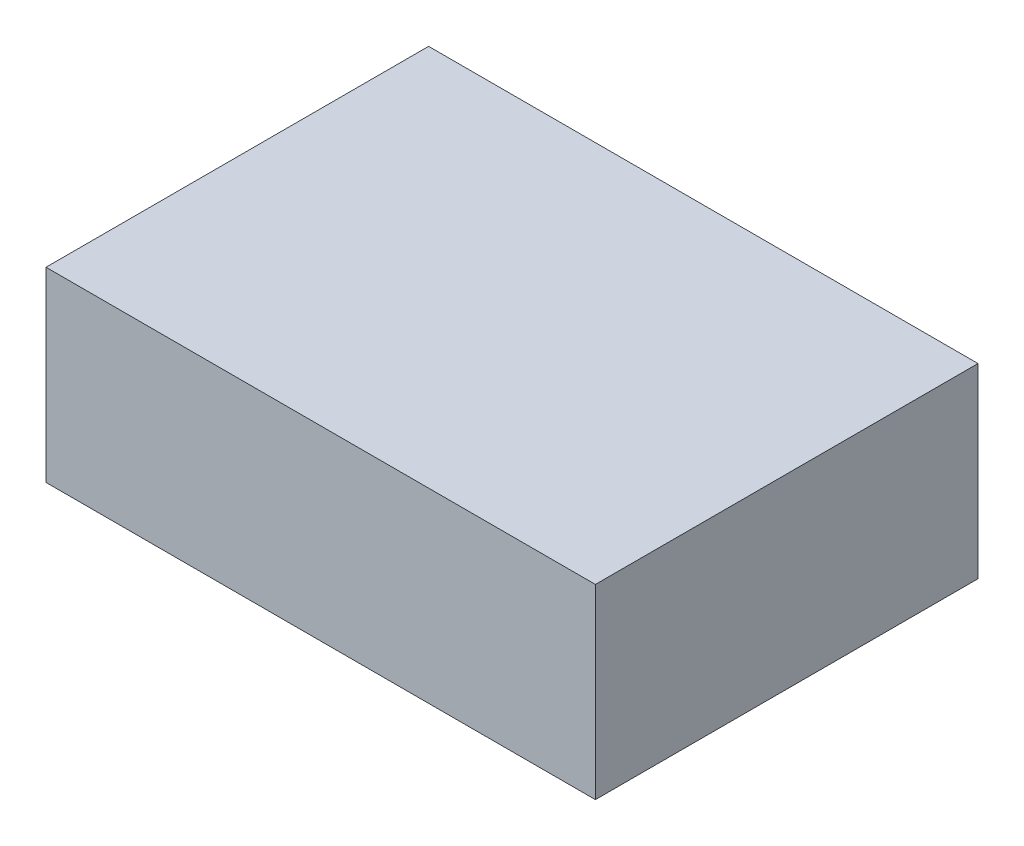
ISO-10303-21;
HEADER;
FILE_DESCRIPTION(('STEP AP214'),'2;1');
FILE_NAME('part.step','',(''),(''),'','','');
FILE_SCHEMA(('AUTOMOTIVE_DESIGN { 1 0 10303 214 1 1 1 1 }'));
ENDSEC;
DATA;
#1=APPLICATION_CONTEXT('core data for automotive mechanical design processes');
#2=APPLICATION_PROTOCOL_DEFINITION('international standard','automotive_design',2000,#1);
#3=PRODUCT_CONTEXT('',#1,'mechanical');
#4=PRODUCT('Part','Part','',(#3));
#5=PRODUCT_RELATED_PRODUCT_CATEGORY('part','',(#4));
#6=PRODUCT_DEFINITION_FORMATION('','',#4);
#7=PRODUCT_DEFINITION_CONTEXT('part definition',#1,'design');
#8=PRODUCT_DEFINITION('design','',#6,#7);
#9=PRODUCT_DEFINITION_SHAPE('','',#8);
#10=(LENGTH_UNIT() NAMED_UNIT(*) SI_UNIT(.MILLI.,.METRE.));
#11=(NAMED_UNIT(*) PLANE_ANGLE_UNIT() SI_UNIT($,.RADIAN.));
#12=(NAMED_UNIT(*) SI_UNIT($,.STERADIAN.) SOLID_ANGLE_UNIT());
#13=UNCERTAINTY_MEASURE_WITH_UNIT(LENGTH_MEASURE(1.E-05),#10,'distance_accuracy_value','');
#14=(GEOMETRIC_REPRESENTATION_CONTEXT(3) GLOBAL_UNCERTAINTY_ASSIGNED_CONTEXT((#13)) GLOBAL_UNIT_ASSIGNED_CONTEXT((#10,
#11,#12)) REPRESENTATION_CONTEXT('',''));
#15=CARTESIAN_POINT('',(0.,0.,0.));
#16=DIRECTION('',(0.,0.,1.));
#17=DIRECTION('',(1.,0.,0.));
#18=AXIS2_PLACEMENT_3D('',#15,#16,#17);
#19=CARTESIAN_POINT('',(56.,38.,-39.));
#20=DIRECTION('',(-1.,0.,0.));
#21=DIRECTION('',(0.,0.,1.));
#22=AXIS2_PLACEMENT_3D('',#19,#20,#21);
#23=PLANE('',#22);
#24=DIRECTION('',(0.,0.,-1.));
#25=VECTOR('',#24,1.);
#26=CARTESIAN_POINT('',(56.,0.,-39.));
#27=LINE('',#26,#25);
#28=CARTESIAN_POINT('',(56.,0.,39.));
#29=VERTEX_POINT('',#28);
#30=CARTESIAN_POINT('',(56.,0.,-39.));
#31=VERTEX_POINT('',#30);
#32=EDGE_CURVE('E107',#29,#31,#27,.T.);
#33=ORIENTED_EDGE('',*,*,#32,.T.);
#34=DIRECTION('',(0.,-1.,0.));
#35=VECTOR('',#34,1.);
#36=CARTESIAN_POINT('',(56.,38.,-39.));
#37=LINE('',#36,#35);
#38=CARTESIAN_POINT('',(56.,38.,-39.));
#39=VERTEX_POINT('',#38);
#40=EDGE_CURVE('E11',#39,#31,#37,.T.);
#41=ORIENTED_EDGE('',*,*,#40,.F.);
#42=DIRECTION('',(0.,0.,-1.));
#43=VECTOR('',#42,1.);
#44=CARTESIAN_POINT('',(56.,38.,-39.));
#45=LINE('',#44,#43);
#46=CARTESIAN_POINT('',(56.,38.,39.));
#47=VERTEX_POINT('',#46);
#48=EDGE_CURVE('E91',#47,#39,#45,.T.);
#49=ORIENTED_EDGE('',*,*,#48,.F.);
#50=DIRECTION('',(0.,-1.,0.));
#51=VECTOR('',#50,1.);
#52=CARTESIAN_POINT('',(56.,38.,39.));
#53=LINE('',#52,#51);
#54=EDGE_CURVE('E103',#47,#29,#53,.T.);
#55=ORIENTED_EDGE('',*,*,#54,.T.);
#56=EDGE_LOOP('',(#33,#41,#49,#55));
#57=FACE_BOUND('',#56,.T.);
#58=ADVANCED_FACE('F39',(#57),#23,.F.);
#59=CARTESIAN_POINT('',(-56.,38.,-39.));
#60=DIRECTION('',(0.,0.,1.));
#61=DIRECTION('',(1.,0.,0.));
#62=AXIS2_PLACEMENT_3D('',#59,#60,#61);
#63=PLANE('',#62);
#64=DIRECTION('',(-1.,0.,0.));
#65=VECTOR('',#64,1.);
#66=CARTESIAN_POINT('',(-56.,0.,-39.));
#67=LINE('',#66,#65);
#68=CARTESIAN_POINT('',(-56.,0.,-39.));
#69=VERTEX_POINT('',#68);
#70=EDGE_CURVE('E96',#31,#69,#67,.T.);
#71=ORIENTED_EDGE('',*,*,#70,.T.);
#72=DIRECTION('',(0.,-1.,0.));
#73=VECTOR('',#72,1.);
#74=CARTESIAN_POINT('',(-56.,38.,-39.));
#75=LINE('',#74,#73);
#76=CARTESIAN_POINT('',(-56.,38.,-39.));
#77=VERTEX_POINT('',#76);
#78=EDGE_CURVE('E48',#77,#69,#75,.T.);
#79=ORIENTED_EDGE('',*,*,#78,.F.);
#80=DIRECTION('',(-1.,0.,0.));
#81=VECTOR('',#80,1.);
#82=CARTESIAN_POINT('',(-56.,38.,-39.));
#83=LINE('',#82,#81);
#84=EDGE_CURVE('E86',#39,#77,#83,.T.);
#85=ORIENTED_EDGE('',*,*,#84,.F.);
#86=ORIENTED_EDGE('',*,*,#40,.T.);
#87=EDGE_LOOP('',(#71,#79,#85,#86));
#88=FACE_BOUND('',#87,.T.);
#89=ADVANCED_FACE('F95',(#88),#63,.F.);
#90=CARTESIAN_POINT('',(-56.,38.,-39.));
#91=DIRECTION('',(1.,0.,0.));
#92=DIRECTION('',(0.,0.,-1.));
#93=AXIS2_PLACEMENT_3D('',#90,#91,#92);
#94=PLANE('',#93);
#95=DIRECTION('',(0.,0.,1.));
#96=VECTOR('',#95,1.);
#97=CARTESIAN_POINT('',(-56.,0.,-39.));
#98=LINE('',#97,#96);
#99=CARTESIAN_POINT('',(-56.,0.,39.));
#100=VERTEX_POINT('',#99);
#101=EDGE_CURVE('E73',#69,#100,#98,.T.);
#102=ORIENTED_EDGE('',*,*,#101,.T.);
#103=DIRECTION('',(0.,-1.,0.));
#104=VECTOR('',#103,1.);
#105=CARTESIAN_POINT('',(-56.,38.,39.));
#106=LINE('',#105,#104);
#107=CARTESIAN_POINT('',(-56.,38.,39.));
#108=VERTEX_POINT('',#107);
#109=EDGE_CURVE('E98',#108,#100,#106,.T.);
#110=ORIENTED_EDGE('',*,*,#109,.F.);
#111=DIRECTION('',(0.,0.,1.));
#112=VECTOR('',#111,1.);
#113=CARTESIAN_POINT('',(-56.,38.,-39.));
#114=LINE('',#113,#112);
#115=EDGE_CURVE('E89',#77,#108,#114,.T.);
#116=ORIENTED_EDGE('',*,*,#115,.F.);
#117=ORIENTED_EDGE('',*,*,#78,.T.);
#118=EDGE_LOOP('',(#102,#110,#116,#117));
#119=FACE_BOUND('',#118,.T.);
#120=ADVANCED_FACE('F99',(#119),#94,.F.);
#121=CARTESIAN_POINT('',(-56.,38.,39.));
#122=DIRECTION('',(0.,0.,-1.));
#123=DIRECTION('',(-1.,0.,0.));
#124=AXIS2_PLACEMENT_3D('',#121,#122,#123);
#125=PLANE('',#124);
#126=DIRECTION('',(1.,0.,0.));
#127=VECTOR('',#126,1.);
#128=CARTESIAN_POINT('',(-56.,0.,39.));
#129=LINE('',#128,#127);
#130=EDGE_CURVE('E79',#100,#29,#129,.T.);
#131=ORIENTED_EDGE('',*,*,#130,.T.);
#132=ORIENTED_EDGE('',*,*,#54,.F.);
#133=DIRECTION('',(1.,0.,0.));
#134=VECTOR('',#133,1.);
#135=CARTESIAN_POINT('',(-56.,38.,39.));
#136=LINE('',#135,#134);
#137=EDGE_CURVE('E56',#108,#47,#136,.T.);
#138=ORIENTED_EDGE('',*,*,#137,.F.);
#139=ORIENTED_EDGE('',*,*,#109,.T.);
#140=EDGE_LOOP('',(#131,#132,#138,#139));
#141=FACE_BOUND('',#140,.T.);
#142=ADVANCED_FACE('F120',(#141),#125,.F.);
#143=CARTESIAN_POINT('',(0.,38.,0.));
#144=DIRECTION('',(0.,1.,0.));
#145=DIRECTION('',(0.,0.,1.));
#146=AXIS2_PLACEMENT_3D('',#143,#144,#145);
#147=PLANE('',#146);
#148=ORIENTED_EDGE('',*,*,#48,.T.);
#149=ORIENTED_EDGE('',*,*,#84,.T.);
#150=ORIENTED_EDGE('',*,*,#115,.T.);
#151=ORIENTED_EDGE('',*,*,#137,.T.);
#152=EDGE_LOOP('',(#148,#149,#150,#151));
#153=FACE_BOUND('',#152,.T.);
#154=ADVANCED_FACE('F87',(#153),#147,.T.);
#155=CARTESIAN_POINT('',(0.,0.,0.));
#156=DIRECTION('',(0.,1.,0.));
#157=DIRECTION('',(0.,0.,1.));
#158=AXIS2_PLACEMENT_3D('',#155,#156,#157);
#159=PLANE('',#158);
#160=ORIENTED_EDGE('',*,*,#32,.F.);
#161=ORIENTED_EDGE('',*,*,#130,.F.);
#162=ORIENTED_EDGE('',*,*,#101,.F.);
#163=ORIENTED_EDGE('',*,*,#70,.F.);
#164=EDGE_LOOP('',(#160,#161,#162,#163));
#165=FACE_BOUND('',#164,.T.);
#166=ADVANCED_FACE('F123',(#165),#159,.F.);
#167=CLOSED_SHELL('',(#58,#89,#120,#142,#154,#166));
#168=MANIFOLD_SOLID_BREP('B2',#167);
#169=ADVANCED_BREP_SHAPE_REPRESENTATION('',(#18,#168),#14);
#170=SHAPE_DEFINITION_REPRESENTATION(#9,#169);
ENDSEC;
END-ISO-10303-21;
